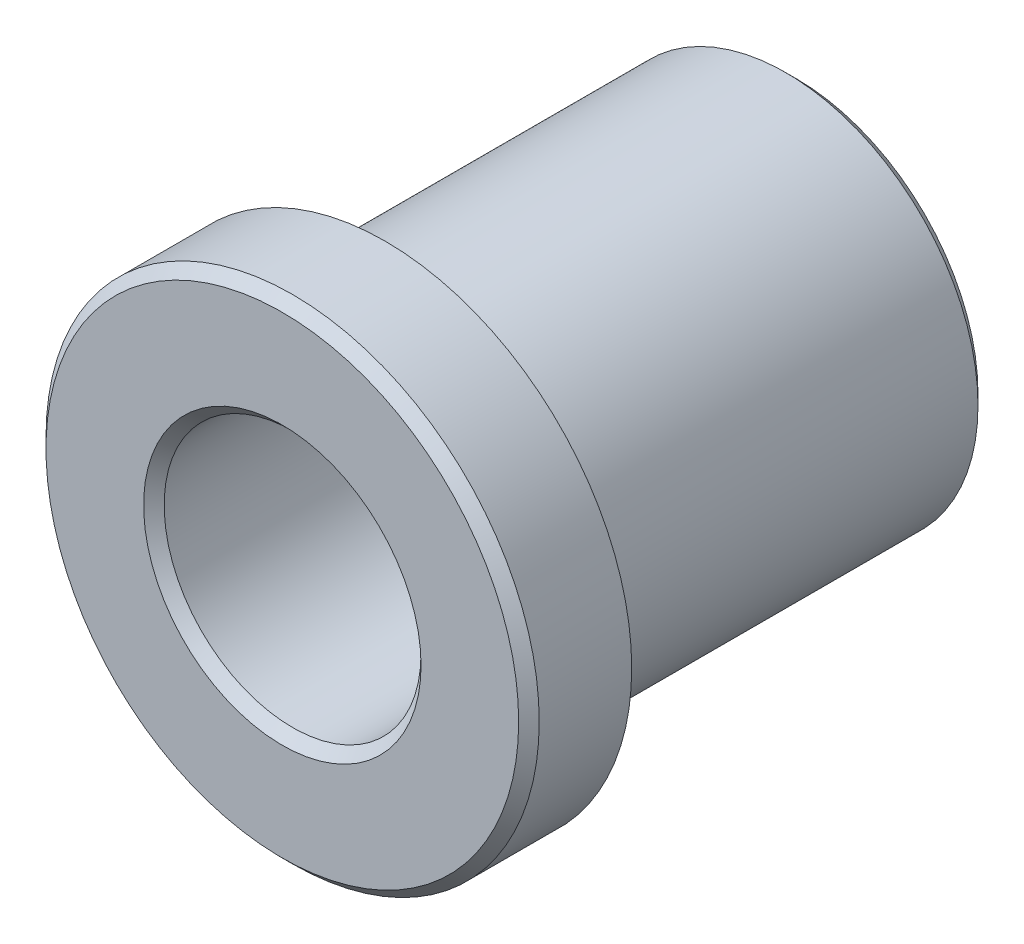
ISO-10303-21;
HEADER;
FILE_DESCRIPTION(('STEP AP214'),'2;1');
FILE_NAME('part.step','',(''),(''),'','','');
FILE_SCHEMA(('AUTOMOTIVE_DESIGN { 1 0 10303 214 1 1 1 1 }'));
ENDSEC;
DATA;
#1=APPLICATION_CONTEXT('core data for automotive mechanical design processes');
#2=APPLICATION_PROTOCOL_DEFINITION('international standard','automotive_design',2000,#1);
#3=PRODUCT_CONTEXT('',#1,'mechanical');
#4=PRODUCT('Part','Part','',(#3));
#5=PRODUCT_RELATED_PRODUCT_CATEGORY('part','',(#4));
#6=PRODUCT_DEFINITION_FORMATION('','',#4);
#7=PRODUCT_DEFINITION_CONTEXT('part definition',#1,'design');
#8=PRODUCT_DEFINITION('design','',#6,#7);
#9=PRODUCT_DEFINITION_SHAPE('','',#8);
#10=(LENGTH_UNIT() NAMED_UNIT(*) SI_UNIT(.MILLI.,.METRE.));
#11=(NAMED_UNIT(*) PLANE_ANGLE_UNIT() SI_UNIT($,.RADIAN.));
#12=(NAMED_UNIT(*) SI_UNIT($,.STERADIAN.) SOLID_ANGLE_UNIT());
#13=UNCERTAINTY_MEASURE_WITH_UNIT(LENGTH_MEASURE(1.E-05),#10,'distance_accuracy_value','');
#14=(GEOMETRIC_REPRESENTATION_CONTEXT(3) GLOBAL_UNCERTAINTY_ASSIGNED_CONTEXT((#13)) GLOBAL_UNIT_ASSIGNED_CONTEXT((#10,
#11,#12)) REPRESENTATION_CONTEXT('',''));
#15=CARTESIAN_POINT('',(0.,0.,0.));
#16=DIRECTION('',(0.,0.,1.));
#17=DIRECTION('',(1.,0.,0.));
#18=AXIS2_PLACEMENT_3D('',#15,#16,#17);
#19=CARTESIAN_POINT('',(0.,0.,-0.253999999999999));
#20=DIRECTION('',(0.,0.,-1.));
#21=DIRECTION('',(-1.,0.,0.));
#22=AXIS2_PLACEMENT_3D('',#19,#20,#21);
#23=CONICAL_SURFACE('',#22,6.096,0.78539816339745);
#24=CARTESIAN_POINT('',(0.,0.,0.));
#25=DIRECTION('',(0.,0.,1.));
#26=DIRECTION('',(1.,0.,0.));
#27=AXIS2_PLACEMENT_3D('',#24,#25,#26);
#28=CIRCLE('',#27,5.842);
#29=CARTESIAN_POINT('',(5.842,0.,0.));
#30=VERTEX_POINT('',#29);
#31=EDGE_CURVE('E52',#30,#30,#28,.T.);
#32=ORIENTED_EDGE('',*,*,#31,.F.);
#33=EDGE_LOOP('',(#32));
#34=FACE_BOUND('',#33,.T.);
#35=CARTESIAN_POINT('',(0.,0.,-0.253999999999999));
#36=DIRECTION('',(0.,0.,1.));
#37=DIRECTION('',(1.,0.,0.));
#38=AXIS2_PLACEMENT_3D('',#35,#36,#37);
#39=CIRCLE('',#38,6.096);
#40=CARTESIAN_POINT('',(6.096,0.,-0.253999999999999));
#41=VERTEX_POINT('',#40);
#42=EDGE_CURVE('E8',#41,#41,#39,.T.);
#43=ORIENTED_EDGE('',*,*,#42,.T.);
#44=EDGE_LOOP('',(#43));
#45=FACE_BOUND('',#44,.T.);
#46=ADVANCED_FACE('F12',(#34,#45),#23,.T.);
#47=CARTESIAN_POINT('',(0.,0.,0.));
#48=DIRECTION('',(0.,0.,1.));
#49=DIRECTION('',(1.,0.,0.));
#50=AXIS2_PLACEMENT_3D('',#47,#48,#49);
#51=CYLINDRICAL_SURFACE('',#50,6.096);
#52=ORIENTED_EDGE('',*,*,#42,.F.);
#53=EDGE_LOOP('',(#52));
#54=FACE_BOUND('',#53,.T.);
#55=CARTESIAN_POINT('',(0.,0.,-2.54));
#56=DIRECTION('',(0.,0.,1.));
#57=DIRECTION('',(1.,0.,0.));
#58=AXIS2_PLACEMENT_3D('',#55,#56,#57);
#59=CIRCLE('',#58,6.096);
#60=CARTESIAN_POINT('',(6.096,0.,-2.54));
#61=VERTEX_POINT('',#60);
#62=EDGE_CURVE('E18',#61,#61,#59,.T.);
#63=ORIENTED_EDGE('',*,*,#62,.T.);
#64=EDGE_LOOP('',(#63));
#65=FACE_BOUND('',#64,.T.);
#66=ADVANCED_FACE('F59',(#54,#65),#51,.T.);
#67=CARTESIAN_POINT('',(0.,6.096,-2.54));
#68=DIRECTION('',(0.,0.,1.));
#69=DIRECTION('',(1.,0.,0.));
#70=AXIS2_PLACEMENT_3D('',#67,#68,#69);
#71=PLANE('',#70);
#72=ORIENTED_EDGE('',*,*,#62,.F.);
#73=EDGE_LOOP('',(#72));
#74=FACE_BOUND('',#73,.T.);
#75=CARTESIAN_POINT('',(0.,0.,-2.54));
#76=DIRECTION('',(0.,0.,1.));
#77=DIRECTION('',(1.,0.,0.));
#78=AXIS2_PLACEMENT_3D('',#75,#76,#77);
#79=CIRCLE('',#78,4.4958);
#80=CARTESIAN_POINT('',(4.4958,0.,-2.54));
#81=VERTEX_POINT('',#80);
#82=EDGE_CURVE('E22',#81,#81,#79,.T.);
#83=ORIENTED_EDGE('',*,*,#82,.T.);
#84=EDGE_LOOP('',(#83));
#85=FACE_BOUND('',#84,.T.);
#86=ADVANCED_FACE('F64',(#74,#85),#71,.F.);
#87=CARTESIAN_POINT('',(0.,0.,0.));
#88=DIRECTION('',(0.,0.,1.));
#89=DIRECTION('',(1.,0.,0.));
#90=AXIS2_PLACEMENT_3D('',#87,#88,#89);
#91=CYLINDRICAL_SURFACE('',#90,4.4958);
#92=ORIENTED_EDGE('',*,*,#82,.F.);
#93=EDGE_LOOP('',(#92));
#94=FACE_BOUND('',#93,.T.);
#95=CARTESIAN_POINT('',(0.,0.,-3.302));
#96=DIRECTION('',(0.,0.,1.));
#97=DIRECTION('',(1.,0.,0.));
#98=AXIS2_PLACEMENT_3D('',#95,#96,#97);
#99=CIRCLE('',#98,4.4958);
#100=CARTESIAN_POINT('',(4.4958,0.,-3.302));
#101=VERTEX_POINT('',#100);
#102=EDGE_CURVE('E26',#101,#101,#99,.T.);
#103=ORIENTED_EDGE('',*,*,#102,.T.);
#104=EDGE_LOOP('',(#103));
#105=FACE_BOUND('',#104,.T.);
#106=ADVANCED_FACE('F69',(#94,#105),#91,.T.);
#107=CARTESIAN_POINT('',(0.,4.4958,-3.302));
#108=DIRECTION('',(0.,0.,-1.));
#109=DIRECTION('',(-1.,0.,0.));
#110=AXIS2_PLACEMENT_3D('',#107,#108,#109);
#111=PLANE('',#110);
#112=ORIENTED_EDGE('',*,*,#102,.F.);
#113=EDGE_LOOP('',(#112));
#114=FACE_BOUND('',#113,.T.);
#115=CARTESIAN_POINT('',(0.,0.,-3.302));
#116=DIRECTION('',(0.,0.,1.));
#117=DIRECTION('',(1.,0.,0.));
#118=AXIS2_PLACEMENT_3D('',#115,#116,#117);
#119=CIRCLE('',#118,4.7498);
#120=CARTESIAN_POINT('',(4.7498,0.,-3.302));
#121=VERTEX_POINT('',#120);
#122=EDGE_CURVE('E31',#121,#121,#119,.T.);
#123=ORIENTED_EDGE('',*,*,#122,.T.);
#124=EDGE_LOOP('',(#123));
#125=FACE_BOUND('',#124,.T.);
#126=ADVANCED_FACE('F75',(#114,#125),#111,.F.);
#127=CARTESIAN_POINT('',(0.,0.,0.));
#128=DIRECTION('',(0.,0.,1.));
#129=DIRECTION('',(1.,0.,0.));
#130=AXIS2_PLACEMENT_3D('',#127,#128,#129);
#131=CYLINDRICAL_SURFACE('',#130,4.7498);
#132=ORIENTED_EDGE('',*,*,#122,.F.);
#133=EDGE_LOOP('',(#132));
#134=FACE_BOUND('',#133,.T.);
#135=CARTESIAN_POINT('',(0.,0.,-12.446));
#136=DIRECTION('',(0.,0.,1.));
#137=DIRECTION('',(1.,0.,0.));
#138=AXIS2_PLACEMENT_3D('',#135,#136,#137);
#139=CIRCLE('',#138,4.7498);
#140=CARTESIAN_POINT('',(4.7498,0.,-12.446));
#141=VERTEX_POINT('',#140);
#142=EDGE_CURVE('E34',#141,#141,#139,.T.);
#143=ORIENTED_EDGE('',*,*,#142,.T.);
#144=EDGE_LOOP('',(#143));
#145=FACE_BOUND('',#144,.T.);
#146=ADVANCED_FACE('F79',(#134,#145),#131,.T.);
#147=CARTESIAN_POINT('',(0.,0.,-12.7));
#148=DIRECTION('',(0.,0.,1.));
#149=DIRECTION('',(1.,0.,0.));
#150=AXIS2_PLACEMENT_3D('',#147,#148,#149);
#151=CONICAL_SURFACE('',#150,4.4958,0.785398163397445);
#152=ORIENTED_EDGE('',*,*,#142,.F.);
#153=EDGE_LOOP('',(#152));
#154=FACE_BOUND('',#153,.T.);
#155=CARTESIAN_POINT('',(0.,0.,-12.7));
#156=DIRECTION('',(0.,0.,1.));
#157=DIRECTION('',(1.,0.,0.));
#158=AXIS2_PLACEMENT_3D('',#155,#156,#157);
#159=CIRCLE('',#158,4.4958);
#160=CARTESIAN_POINT('',(4.4958,0.,-12.7));
#161=VERTEX_POINT('',#160);
#162=EDGE_CURVE('E37',#161,#161,#159,.T.);
#163=ORIENTED_EDGE('',*,*,#162,.T.);
#164=EDGE_LOOP('',(#163));
#165=FACE_BOUND('',#164,.T.);
#166=ADVANCED_FACE('F83',(#154,#165),#151,.T.);
#167=CARTESIAN_POINT('',(0.,3.429,-12.7));
#168=DIRECTION('',(0.,0.,1.));
#169=DIRECTION('',(1.,0.,0.));
#170=AXIS2_PLACEMENT_3D('',#167,#168,#169);
#171=PLANE('',#170);
#172=ORIENTED_EDGE('',*,*,#162,.F.);
#173=EDGE_LOOP('',(#172));
#174=FACE_BOUND('',#173,.T.);
#175=CARTESIAN_POINT('',(0.,0.,-12.7));
#176=DIRECTION('',(0.,0.,1.));
#177=DIRECTION('',(1.,0.,0.));
#178=AXIS2_PLACEMENT_3D('',#175,#176,#177);
#179=CIRCLE('',#178,3.429);
#180=CARTESIAN_POINT('',(3.429,0.,-12.7));
#181=VERTEX_POINT('',#180);
#182=EDGE_CURVE('E40',#181,#181,#179,.T.);
#183=ORIENTED_EDGE('',*,*,#182,.T.);
#184=EDGE_LOOP('',(#183));
#185=FACE_BOUND('',#184,.T.);
#186=ADVANCED_FACE('F87',(#174,#185),#171,.F.);
#187=CARTESIAN_POINT('',(0.,0.,-12.446));
#188=DIRECTION('',(0.,0.,-1.));
#189=DIRECTION('',(-1.,0.,0.));
#190=AXIS2_PLACEMENT_3D('',#187,#188,#189);
#191=CONICAL_SURFACE('',#190,3.175,0.785398163397447);
#192=ORIENTED_EDGE('',*,*,#182,.F.);
#193=EDGE_LOOP('',(#192));
#194=FACE_BOUND('',#193,.T.);
#195=CARTESIAN_POINT('',(0.,0.,-12.446));
#196=DIRECTION('',(0.,0.,1.));
#197=DIRECTION('',(1.,0.,0.));
#198=AXIS2_PLACEMENT_3D('',#195,#196,#197);
#199=CIRCLE('',#198,3.175);
#200=CARTESIAN_POINT('',(3.175,0.,-12.446));
#201=VERTEX_POINT('',#200);
#202=EDGE_CURVE('E43',#201,#201,#199,.T.);
#203=ORIENTED_EDGE('',*,*,#202,.T.);
#204=EDGE_LOOP('',(#203));
#205=FACE_BOUND('',#204,.T.);
#206=ADVANCED_FACE('F91',(#194,#205),#191,.F.);
#207=CARTESIAN_POINT('',(0.,0.,0.));
#208=DIRECTION('',(0.,0.,1.));
#209=DIRECTION('',(1.,0.,0.));
#210=AXIS2_PLACEMENT_3D('',#207,#208,#209);
#211=CYLINDRICAL_SURFACE('',#210,3.175);
#212=ORIENTED_EDGE('',*,*,#202,.F.);
#213=EDGE_LOOP('',(#212));
#214=FACE_BOUND('',#213,.T.);
#215=CARTESIAN_POINT('',(0.,0.,-0.253999999999999));
#216=DIRECTION('',(0.,0.,1.));
#217=DIRECTION('',(1.,0.,0.));
#218=AXIS2_PLACEMENT_3D('',#215,#216,#217);
#219=CIRCLE('',#218,3.175);
#220=CARTESIAN_POINT('',(3.175,0.,-0.253999999999999));
#221=VERTEX_POINT('',#220);
#222=EDGE_CURVE('E46',#221,#221,#219,.T.);
#223=ORIENTED_EDGE('',*,*,#222,.T.);
#224=EDGE_LOOP('',(#223));
#225=FACE_BOUND('',#224,.T.);
#226=ADVANCED_FACE('F95',(#214,#225),#211,.F.);
#227=CARTESIAN_POINT('',(0.,0.,0.));
#228=DIRECTION('',(0.,0.,1.));
#229=DIRECTION('',(1.,0.,0.));
#230=AXIS2_PLACEMENT_3D('',#227,#228,#229);
#231=CONICAL_SURFACE('',#230,3.429,0.78539816339745);
#232=ORIENTED_EDGE('',*,*,#222,.F.);
#233=EDGE_LOOP('',(#232));
#234=FACE_BOUND('',#233,.T.);
#235=CARTESIAN_POINT('',(0.,0.,0.));
#236=DIRECTION('',(0.,0.,1.));
#237=DIRECTION('',(1.,0.,0.));
#238=AXIS2_PLACEMENT_3D('',#235,#236,#237);
#239=CIRCLE('',#238,3.429);
#240=CARTESIAN_POINT('',(3.429,0.,0.));
#241=VERTEX_POINT('',#240);
#242=EDGE_CURVE('E49',#241,#241,#239,.T.);
#243=ORIENTED_EDGE('',*,*,#242,.T.);
#244=EDGE_LOOP('',(#243));
#245=FACE_BOUND('',#244,.T.);
#246=ADVANCED_FACE('F99',(#234,#245),#231,.F.);
#247=CARTESIAN_POINT('',(0.,3.429,0.));
#248=DIRECTION('',(0.,0.,-1.));
#249=DIRECTION('',(-1.,0.,0.));
#250=AXIS2_PLACEMENT_3D('',#247,#248,#249);
#251=PLANE('',#250);
#252=ORIENTED_EDGE('',*,*,#242,.F.);
#253=EDGE_LOOP('',(#252));
#254=FACE_BOUND('',#253,.T.);
#255=ORIENTED_EDGE('',*,*,#31,.T.);
#256=EDGE_LOOP('',(#255));
#257=FACE_BOUND('',#256,.T.);
#258=ADVANCED_FACE('F56',(#254,#257),#251,.F.);
#259=CLOSED_SHELL('',(#46,#66,#86,#106,#126,#146,#166,#186,#206,#226,#246,#258));
#260=MANIFOLD_SOLID_BREP('B1',#259);
#261=ADVANCED_BREP_SHAPE_REPRESENTATION('',(#18,#260),#14);
#262=SHAPE_DEFINITION_REPRESENTATION(#9,#261);
ENDSEC;
END-ISO-10303-21;
